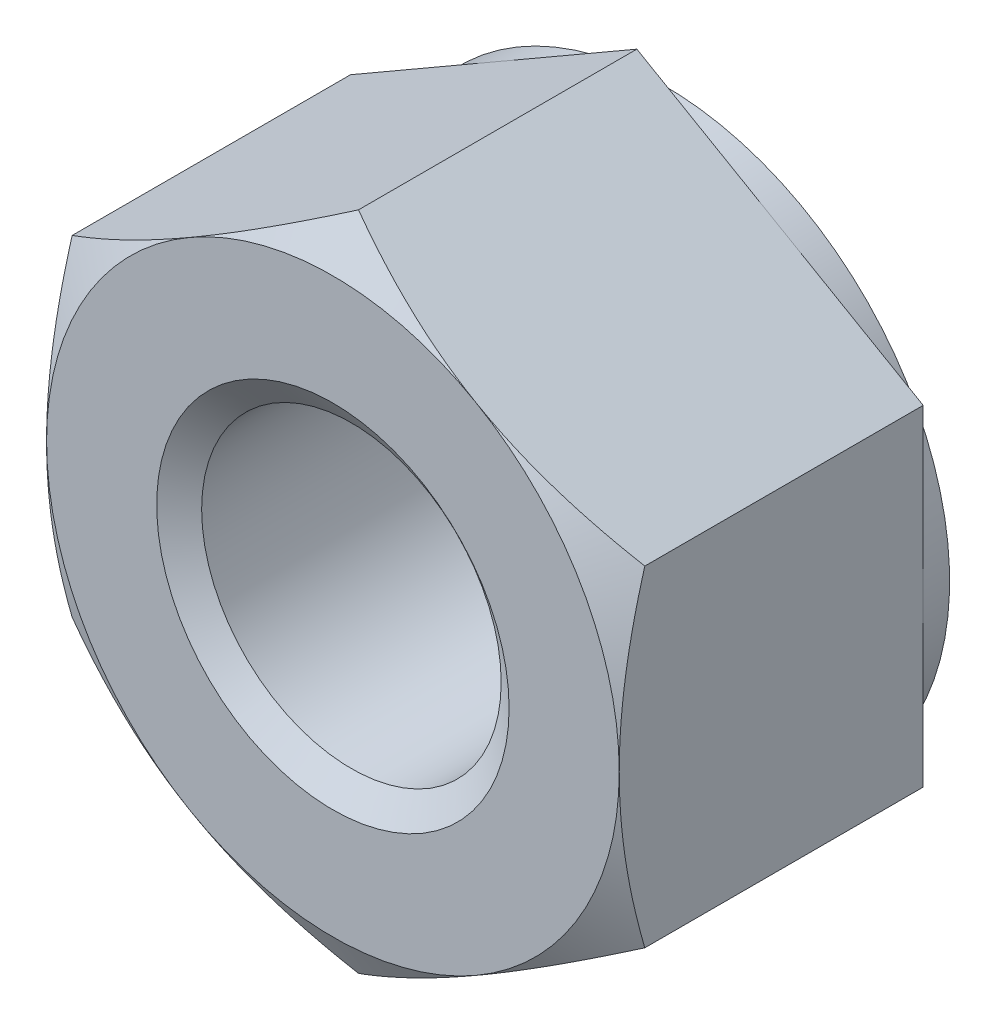
ISO-10303-21;
HEADER;
FILE_DESCRIPTION(('STEP AP214'),'2;1');
FILE_NAME('part.step','',(''),(''),'','','');
FILE_SCHEMA(('AUTOMOTIVE_DESIGN { 1 0 10303 214 1 1 1 1 }'));
ENDSEC;
DATA;
#1=APPLICATION_CONTEXT('core data for automotive mechanical design processes');
#2=APPLICATION_PROTOCOL_DEFINITION('international standard','automotive_design',2000,#1);
#3=PRODUCT_CONTEXT('',#1,'mechanical');
#4=PRODUCT('Part','Part','',(#3));
#5=PRODUCT_RELATED_PRODUCT_CATEGORY('part','',(#4));
#6=PRODUCT_DEFINITION_FORMATION('','',#4);
#7=PRODUCT_DEFINITION_CONTEXT('part definition',#1,'design');
#8=PRODUCT_DEFINITION('design','',#6,#7);
#9=PRODUCT_DEFINITION_SHAPE('','',#8);
#10=(LENGTH_UNIT() NAMED_UNIT(*) SI_UNIT(.MILLI.,.METRE.));
#11=(NAMED_UNIT(*) PLANE_ANGLE_UNIT() SI_UNIT($,.RADIAN.));
#12=(NAMED_UNIT(*) SI_UNIT($,.STERADIAN.) SOLID_ANGLE_UNIT());
#13=UNCERTAINTY_MEASURE_WITH_UNIT(LENGTH_MEASURE(1.E-05),#10,'distance_accuracy_value','');
#14=(GEOMETRIC_REPRESENTATION_CONTEXT(3) GLOBAL_UNCERTAINTY_ASSIGNED_CONTEXT((#13)) GLOBAL_UNIT_ASSIGNED_CONTEXT((#10,
#11,#12)) REPRESENTATION_CONTEXT('',''));
#15=CARTESIAN_POINT('',(0.,0.,0.));
#16=DIRECTION('',(0.,0.,1.));
#17=DIRECTION('',(1.,0.,0.));
#18=AXIS2_PLACEMENT_3D('',#15,#16,#17);
#19=CARTESIAN_POINT('',(0.,0.,-7.5));
#20=DIRECTION('',(0.,0.,1.));
#21=DIRECTION('',(1.,0.,0.));
#22=AXIS2_PLACEMENT_3D('',#19,#20,#21);
#23=CYLINDRICAL_SURFACE('',#22,3.4);
#24=CARTESIAN_POINT('',(0.,0.,-0.420124522925826));
#25=DIRECTION('',(0.,0.,1.));
#26=DIRECTION('',(1.,0.,0.));
#27=AXIS2_PLACEMENT_3D('',#24,#25,#26);
#28=CIRCLE('',#27,3.4);
#29=CARTESIAN_POINT('',(3.4,0.,-0.420124522925826));
#30=VERTEX_POINT('',#29);
#31=EDGE_CURVE('E153',#30,#30,#28,.F.);
#32=ORIENTED_EDGE('',*,*,#31,.F.);
#33=EDGE_LOOP('',(#32));
#34=FACE_BOUND('',#33,.T.);
#35=CARTESIAN_POINT('',(0.,0.,-7.05447547707417));
#36=DIRECTION('',(0.,0.,-1.));
#37=DIRECTION('',(-1.,0.,0.));
#38=AXIS2_PLACEMENT_3D('',#35,#36,#37);
#39=CIRCLE('',#38,3.4);
#40=CARTESIAN_POINT('',(-3.4,0.,-7.05447547707417));
#41=VERTEX_POINT('',#40);
#42=EDGE_CURVE('E41',#41,#41,#39,.F.);
#43=ORIENTED_EDGE('',*,*,#42,.F.);
#44=EDGE_LOOP('',(#43));
#45=FACE_BOUND('',#44,.T.);
#46=ADVANCED_FACE('F36',(#34,#45),#23,.F.);
#47=CARTESIAN_POINT('',(0.,7.50555349946514,-7.5));
#48=DIRECTION('',(-0.500000000000001,0.866025403784438,0.));
#49=DIRECTION('',(-0.866025403784438,-0.500000000000001,0.));
#50=AXIS2_PLACEMENT_3D('',#47,#48,#49);
#51=PLANE('',#50);
#52=DIRECTION('',(0.,0.,1.));
#53=VECTOR('',#52,1.);
#54=CARTESIAN_POINT('',(-6.5,3.75277674973256,-7.5));
#55=LINE('',#54,#53);
#56=CARTESIAN_POINT('',(-6.5,3.75277674973256,-6.9));
#57=VERTEX_POINT('',#56);
#58=CARTESIAN_POINT('',(-6.5,3.75277674973256,-0.580556583600771));
#59=VERTEX_POINT('',#58);
#60=EDGE_CURVE('E294',#57,#59,#55,.T.);
#61=ORIENTED_EDGE('',*,*,#60,.T.);
#62=CARTESIAN_POINT('',(-6.5002,3.75266127967872,-0.58062325180587));
#63=CARTESIAN_POINT('',(-6.35732254094112,3.8351516191275,-0.533004423075488));
#64=CARTESIAN_POINT('',(-6.21391236546509,3.91794952254312,-0.487546700602708));
#65=CARTESIAN_POINT('',(-5.9259273686828,4.08421773795794,-0.401548682023047));
#66=CARTESIAN_POINT('',(-5.78135207342874,4.16768832359105,-0.361010507228026));
#67=CARTESIAN_POINT('',(-5.34531134947997,4.41943655294051,-0.247571001123208));
#68=CARTESIAN_POINT('',(-5.05212471715368,4.58870793403689,-0.183047807128739));
#69=CARTESIAN_POINT('',(-4.61337625445563,4.84201947708215,-0.107386583547491));
#70=CARTESIAN_POINT('',(-4.46912536350531,4.92530276780316,-0.0858328564569863));
#71=CARTESIAN_POINT('',(-4.17997178286191,5.09224566542477,-0.0496903146061179));
#72=CARTESIAN_POINT('',(-4.03506915190111,5.17590523841627,-0.0351008844596657));
#73=CARTESIAN_POINT('',(-3.74501222057168,5.34336968579964,-0.013258752507346));
#74=CARTESIAN_POINT('',(-3.59985839394579,5.427174286676,-0.00599772432210689));
#75=CARTESIAN_POINT('',(-3.30942466302505,5.59485627940483,0.00103969741776935));
#76=CARTESIAN_POINT('',(-3.16414476276364,5.6787336689286,0.000816322187795753));
#77=CARTESIAN_POINT('',(-2.76612405757351,5.90853103021317,-0.0100834585151656));
#78=CARTESIAN_POINT('',(-2.51351353897243,6.05437578112763,-0.0283818178694138));
#79=CARTESIAN_POINT('',(-2.00997032176432,6.34509659313135,-0.0864063414576766));
#80=CARTESIAN_POINT('',(-1.75903939406692,6.48997163178545,-0.126152338538247));
#81=CARTESIAN_POINT('',(-1.25448277935568,6.78127752911039,-0.225505903202153));
#82=CARTESIAN_POINT('',(-1.00092075856409,6.92767163007068,-0.285534425638031));
#83=CARTESIAN_POINT('',(-0.497578064240955,7.21827667013277,-0.421774992509875));
#84=CARTESIAN_POINT('',(-0.247790944447037,7.36249133098589,-0.4979550341636));
#85=CARTESIAN_POINT('',(0.000199999999999409,7.50566896951898,-0.580623251805876));
#86=B_SPLINE_CURVE_WITH_KNOTS('',3,(#62,#63,#64,#65,#66,#67,#68,#69,#70,#71,#72,#73,#74,#75,#76,
#77,#78,#79,#80,#81,#82,#83,#84,#85),.UNSPECIFIED.,.F.,.F.,(4,2,2,2,2,2,2,2,2,2,2,4),(0.,
0.515105052395589,1.03043143507525,2.06322554824263,2.56697389547997,3.07067772176454,
3.57380860368928,4.0769239424252,4.9527935470566,5.82947446853467,6.72559912449737,
7.61996451221046),.UNSPECIFIED.);
#87=CARTESIAN_POINT('',(-3.25000000000001,5.62916512459885,0.));
#88=VERTEX_POINT('',#87);
#89=EDGE_CURVE('E60',#59,#88,#86,.T.);
#90=ORIENTED_EDGE('',*,*,#89,.T.);
#91=CARTESIAN_POINT('',(0.,7.50555349946514,-0.580556583600771));
#92=VERTEX_POINT('',#91);
#93=EDGE_CURVE('E167',#88,#92,#86,.T.);
#94=ORIENTED_EDGE('',*,*,#93,.T.);
#95=DIRECTION('',(0.,0.,1.));
#96=VECTOR('',#95,1.);
#97=CARTESIAN_POINT('',(0.,7.50555349946514,-7.5));
#98=LINE('',#97,#96);
#99=CARTESIAN_POINT('',(0.,7.50555349946514,-6.9));
#100=VERTEX_POINT('',#99);
#101=EDGE_CURVE('E282',#100,#92,#98,.T.);
#102=ORIENTED_EDGE('',*,*,#101,.F.);
#103=DIRECTION('',(-0.866025403784438,-0.500000000000001,0.));
#104=VECTOR('',#103,1.);
#105=CARTESIAN_POINT('',(0.,7.50555349946514,-6.9));
#106=LINE('',#105,#104);
#107=CARTESIAN_POINT('',(-3.25000000000001,5.62916512459885,-6.9));
#108=VERTEX_POINT('',#107);
#109=EDGE_CURVE('E270',#100,#108,#106,.T.);
#110=ORIENTED_EDGE('',*,*,#109,.T.);
#111=EDGE_CURVE('E266',#108,#57,#106,.T.);
#112=ORIENTED_EDGE('',*,*,#111,.T.);
#113=EDGE_LOOP('',(#61,#90,#94,#102,#110,#112));
#114=FACE_BOUND('',#113,.T.);
#115=ADVANCED_FACE('F38',(#114),#51,.T.);
#116=CARTESIAN_POINT('',(6.5,3.75277674973256,-7.5));
#117=DIRECTION('',(0.500000000000001,0.866025403784438,0.));
#118=DIRECTION('',(-0.866025403784438,0.500000000000001,0.));
#119=AXIS2_PLACEMENT_3D('',#116,#117,#118);
#120=PLANE('',#119);
#121=ORIENTED_EDGE('',*,*,#101,.T.);
#122=CARTESIAN_POINT('',(-0.000200000000000618,7.50566896951898,-0.580623251805875));
#123=CARTESIAN_POINT('',(0.142677459058881,7.4231786300702,-0.533004423075493));
#124=CARTESIAN_POINT('',(0.286087634534913,7.34038072665459,-0.487546700602713));
#125=CARTESIAN_POINT('',(0.574072631317196,7.17411251123976,-0.401548682023052));
#126=CARTESIAN_POINT('',(0.718647926571265,7.09064192560665,-0.36101050722803));
#127=CARTESIAN_POINT('',(1.15468865052004,6.83889369625719,-0.247571001123212));
#128=CARTESIAN_POINT('',(1.44787528284632,6.66962231516081,-0.183047807128741));
#129=CARTESIAN_POINT('',(1.88662374554438,6.41631077211555,-0.107386583547493));
#130=CARTESIAN_POINT('',(2.03087463649469,6.33302748139454,-0.0858328564569886));
#131=CARTESIAN_POINT('',(2.32002821713809,6.16608458377293,-0.0496903146061195));
#132=CARTESIAN_POINT('',(2.46493084809889,6.08242501078143,-0.0351008844596667));
#133=CARTESIAN_POINT('',(2.75498777942832,5.91496056339806,-0.0132587525073465));
#134=CARTESIAN_POINT('',(2.90014160605421,5.8311559625217,-0.00599772432210741));
#135=CARTESIAN_POINT('',(3.19057533697495,5.66347396979286,0.00103969741776911));
#136=CARTESIAN_POINT('',(3.33585523723636,5.5795965802691,0.000816322187795874));
#137=CARTESIAN_POINT('',(3.7338759424265,5.34979921898453,-0.0100834585151647));
#138=CARTESIAN_POINT('',(3.98648646102757,5.20395446807007,-0.0283818178694127));
#139=CARTESIAN_POINT('',(4.49002967823568,4.91323365606635,-0.0864063414576745));
#140=CARTESIAN_POINT('',(4.74096060593309,4.76835861741225,-0.126152338538244));
#141=CARTESIAN_POINT('',(5.24551722064432,4.47705272008731,-0.22550590320215));
#142=CARTESIAN_POINT('',(5.49907924143591,4.33065861912702,-0.285534425638028));
#143=CARTESIAN_POINT('',(6.00242193575905,4.04005357906493,-0.421774992509871));
#144=CARTESIAN_POINT('',(6.25220905555296,3.89583891821181,-0.497955034163595));
#145=CARTESIAN_POINT('',(6.5002,3.75266127967872,-0.58062325180587));
#146=B_SPLINE_CURVE_WITH_KNOTS('',3,(#122,#123,#124,#125,#126,#127,#128,#129,#130,#131,#132,
#133,#134,#135,#136,#137,#138,#139,#140,#141,#142,#143,#144,#145),.UNSPECIFIED.,.F.,.F.,(4,2,2,
2,2,2,2,2,2,2,2,4),(0.,0.51510505239559,1.03043143507525,2.06322554824263,2.56697389547997,
3.07067772176454,3.57380860368929,4.07692394242521,4.95279354705661,5.82947446853467,
6.72559912449737,7.61996451221046),.UNSPECIFIED.);
#147=CARTESIAN_POINT('',(3.25000000000001,5.62916512459885,0.));
#148=VERTEX_POINT('',#147);
#149=EDGE_CURVE('E164',#92,#148,#146,.T.);
#150=ORIENTED_EDGE('',*,*,#149,.T.);
#151=CARTESIAN_POINT('',(6.5,3.75277674973258,-0.580556583600771));
#152=VERTEX_POINT('',#151);
#153=EDGE_CURVE('E147',#148,#152,#146,.T.);
#154=ORIENTED_EDGE('',*,*,#153,.T.);
#155=DIRECTION('',(0.,0.,1.));
#156=VECTOR('',#155,1.);
#157=CARTESIAN_POINT('',(6.5,3.75277674973256,-7.5));
#158=LINE('',#157,#156);
#159=CARTESIAN_POINT('',(6.5,3.75277674973256,-6.9));
#160=VERTEX_POINT('',#159);
#161=EDGE_CURVE('E163',#160,#152,#158,.T.);
#162=ORIENTED_EDGE('',*,*,#161,.F.);
#163=DIRECTION('',(-0.866025403784438,0.500000000000001,0.));
#164=VECTOR('',#163,1.);
#165=CARTESIAN_POINT('',(6.5,3.75277674973256,-6.9));
#166=LINE('',#165,#164);
#167=CARTESIAN_POINT('',(3.25000000000001,5.62916512459885,-6.9));
#168=VERTEX_POINT('',#167);
#169=EDGE_CURVE('E278',#160,#168,#166,.T.);
#170=ORIENTED_EDGE('',*,*,#169,.T.);
#171=EDGE_CURVE('E274',#168,#100,#166,.T.);
#172=ORIENTED_EDGE('',*,*,#171,.T.);
#173=EDGE_LOOP('',(#121,#150,#154,#162,#170,#172));
#174=FACE_BOUND('',#173,.T.);
#175=ADVANCED_FACE('F241',(#174),#120,.T.);
#176=CARTESIAN_POINT('',(6.5,3.75277674973256,-7.5));
#177=DIRECTION('',(-1.,0.,0.));
#178=DIRECTION('',(0.,0.,1.));
#179=AXIS2_PLACEMENT_3D('',#176,#177,#178);
#180=PLANE('',#179);
#181=CARTESIAN_POINT('',(6.5,-9.95291698368313,-3.11042358451599));
#182=CARTESIAN_POINT('',(6.5,-9.66753022820205,-2.97250893962365));
#183=CARTESIAN_POINT('',(6.5,-9.38146872221018,-2.8359652810007));
#184=CARTESIAN_POINT('',(6.5,-8.80763137697964,-2.56640336373165));
#185=CARTESIAN_POINT('',(6.5,-8.51985525134959,-2.43338571546935));
#186=CARTESIAN_POINT('',(6.5,-7.94066929123456,-2.17095850209535));
#187=CARTESIAN_POINT('',(6.5,-7.64924808662454,-2.04157394066246));
#188=CARTESIAN_POINT('',(6.5,-7.06401043497073,-1.78836220262284));
#189=CARTESIAN_POINT('',(6.5,-6.77019411372554,-1.66453473633514));
#190=CARTESIAN_POINT('',(6.5,-6.17605150217578,-1.42244480194621));
#191=CARTESIAN_POINT('',(6.5,-5.87568957429354,-1.30426931829828));
#192=CARTESIAN_POINT('',(6.5,-5.27142269448723,-1.07717389386354));
#193=CARTESIAN_POINT('',(6.5,-4.9675173526422,-0.968254982821991));
#194=CARTESIAN_POINT('',(6.5,-4.35630541725461,-0.762599022073943));
#195=CARTESIAN_POINT('',(6.5,-4.04900762614673,-0.665836073792645));
#196=CARTESIAN_POINT('',(6.5,-3.43004022230997,-0.487635712034288));
#197=CARTESIAN_POINT('',(6.5,-3.11837202573309,-0.406193452076782));
#198=CARTESIAN_POINT('',(6.5,-2.49046594828965,-0.26258408019258));
#199=CARTESIAN_POINT('',(6.5,-2.17422687409775,-0.200422100523436));
#200=CARTESIAN_POINT('',(6.5,-1.5378916759482,-0.0995742225329258));
#201=CARTESIAN_POINT('',(6.5,-1.2177955485807,-0.0608883449673845));
#202=CARTESIAN_POINT('',(6.5,-0.737141963129277,-0.0229465620569955));
#203=CARTESIAN_POINT('',(6.5,-0.577336886979719,-0.0136452147630792));
#204=CARTESIAN_POINT('',(6.5,-0.257468906786594,-0.00181408796460747));
#205=CARTESIAN_POINT('',(6.5,-0.0974060061182575,0.000715779477276843));
#206=CARTESIAN_POINT('',(6.5,0.222635442153785,-0.00106401163083594));
#207=CARTESIAN_POINT('',(6.5,0.382614000823772,-0.0053717506870047));
#208=CARTESIAN_POINT('',(6.5,0.702250634961163,-0.0207175825196415));
#209=CARTESIAN_POINT('',(6.5,0.861908694024545,-0.0317560114013203));
#210=CARTESIAN_POINT('',(6.5,1.24887053403167,-0.0664368683339296));
#211=CARTESIAN_POINT('',(6.5,1.47587694728923,-0.0934518785931837));
#212=CARTESIAN_POINT('',(6.5,1.92815030612898,-0.159589888005031));
#213=CARTESIAN_POINT('',(6.5,2.15341675970355,-0.198716192016402));
#214=CARTESIAN_POINT('',(6.5,2.6020242784339,-0.287689170365799));
#215=CARTESIAN_POINT('',(6.5,2.82536331401076,-0.337545980881487));
#216=CARTESIAN_POINT('',(6.5,3.26974354822384,-0.44645876411308));
#217=CARTESIAN_POINT('',(6.5,3.49078496123694,-0.505513870223689));
#218=CARTESIAN_POINT('',(6.5,3.93601414582635,-0.632954116493084));
#219=CARTESIAN_POINT('',(6.5,4.1601462295919,-0.701532472923335));
#220=CARTESIAN_POINT('',(6.5,4.60604131565917,-0.845465123541097));
#221=CARTESIAN_POINT('',(6.5,4.82780583559526,-0.920814744092753));
#222=CARTESIAN_POINT('',(6.5,5.26807593346454,-1.07673350293345));
#223=CARTESIAN_POINT('',(6.5,5.4865928289811,-1.15727087504746));
#224=CARTESIAN_POINT('',(6.5,5.92193123194619,-1.32307270438627));
#225=CARTESIAN_POINT('',(6.5,6.13875201319725,-1.40833907213759));
#226=CARTESIAN_POINT('',(6.5,6.35478510853348,-1.49550213563036));
#227=B_SPLINE_CURVE_WITH_KNOTS('',3,(#181,#182,#183,#184,#185,#186,#187,#188,#189,#190,#191,
#192,#193,#194,#195,#196,#197,#198,#199,#200,#201,#202,#203,#204,#205,#206,#207,#208,#209,#210,
#211,#212,#213,#214,#215,#216,#217,#218,#219,#220,#221,#222,#223,#224,#225,#226),.UNSPECIFIED.,
.F.,.F.,(4,2,2,2,2,2,2,2,2,2,2,2,2,2,2,2,2,2,2,2,2,2,4),(0.,0.950904162864942,1.90197187472378,
2.85848216299728,3.81494253212838,4.78314526620908,5.75145556717361,6.71766655133576,
7.68357137261129,8.64973308985235,9.61589566130056,10.0960003863608,10.5760988765458,
11.0560626144432,11.5360503218788,12.2214931749033,12.9071232326805,13.5934038106301,
14.2796197706252,14.9826563668411,15.6852113891479,16.3838119598016,17.082696852468),.UNSPECIFIED.);
#228=CARTESIAN_POINT('',(6.5,-3.75277674973258,-0.580556583600771));
#229=VERTEX_POINT('',#228);
#230=CARTESIAN_POINT('',(6.5,0.,0.));
#231=VERTEX_POINT('',#230);
#232=EDGE_CURVE('E128',#229,#231,#227,.T.);
#233=ORIENTED_EDGE('',*,*,#232,.F.);
#234=DIRECTION('',(0.,0.,1.));
#235=VECTOR('',#234,1.);
#236=CARTESIAN_POINT('',(6.5,-3.75277674973258,-7.5));
#237=LINE('',#236,#235);
#238=CARTESIAN_POINT('',(6.5,-3.75277674973258,-6.9));
#239=VERTEX_POINT('',#238);
#240=EDGE_CURVE('E287',#239,#229,#237,.T.);
#241=ORIENTED_EDGE('',*,*,#240,.F.);
#242=DIRECTION('',(0.,-1.,0.));
#243=VECTOR('',#242,1.);
#244=CARTESIAN_POINT('',(6.5,3.75277674973256,-6.9));
#245=LINE('',#244,#243);
#246=CARTESIAN_POINT('',(6.5,0.,-6.9));
#247=VERTEX_POINT('',#246);
#248=EDGE_CURVE('E279',#247,#239,#245,.T.);
#249=ORIENTED_EDGE('',*,*,#248,.F.);
#250=EDGE_CURVE('E281',#160,#247,#245,.T.);
#251=ORIENTED_EDGE('',*,*,#250,.F.);
#252=ORIENTED_EDGE('',*,*,#161,.T.);
#253=EDGE_CURVE('E141',#231,#152,#227,.T.);
#254=ORIENTED_EDGE('',*,*,#253,.F.);
#255=EDGE_LOOP('',(#233,#241,#249,#251,#252,#254));
#256=FACE_BOUND('',#255,.T.);
#257=ADVANCED_FACE('F160',(#256),#180,.F.);
#258=CARTESIAN_POINT('',(0.,-7.50555349946516,-7.5));
#259=DIRECTION('',(0.500000000000001,-0.866025403784438,0.));
#260=DIRECTION('',(0.866025403784438,0.500000000000001,0.));
#261=AXIS2_PLACEMENT_3D('',#258,#259,#260);
#262=PLANE('',#261);
#263=ORIENTED_EDGE('',*,*,#240,.T.);
#264=CARTESIAN_POINT('',(6.5002,-3.75266127967874,-0.580623251805876));
#265=CARTESIAN_POINT('',(6.35732254094112,-3.83515161912752,-0.533004423075493));
#266=CARTESIAN_POINT('',(6.21391236546509,-3.91794952254314,-0.487546700602714));
#267=CARTESIAN_POINT('',(5.9259273686828,-4.08421773795796,-0.401548682023052));
#268=CARTESIAN_POINT('',(5.78135207342873,-4.16768832359107,-0.361010507228032));
#269=CARTESIAN_POINT('',(5.34531134947996,-4.41943655294053,-0.247571001123215));
#270=CARTESIAN_POINT('',(5.05212471715368,-4.58870793403691,-0.183047807128746));
#271=CARTESIAN_POINT('',(4.61337625445562,-4.84201947708217,-0.107386583547498));
#272=CARTESIAN_POINT('',(4.46912536350531,-4.92530276780318,-0.0858328564569939));
#273=CARTESIAN_POINT('',(4.17997178286191,-5.09224566542479,-0.0496903146061258));
#274=CARTESIAN_POINT('',(4.03506915190111,-5.17590523841629,-0.0351008844596737));
#275=CARTESIAN_POINT('',(3.74501222057168,-5.34336968579966,-0.0132587525073545));
#276=CARTESIAN_POINT('',(3.59985839394579,-5.42717428667602,-0.00599772432211574));
#277=CARTESIAN_POINT('',(3.30942466302505,-5.59485627940486,0.00103969741776017));
#278=CARTESIAN_POINT('',(3.16414476276364,-5.67873366892862,0.000816322187786624));
#279=CARTESIAN_POINT('',(2.7661240575735,-5.90853103021319,-0.010083458515175));
#280=CARTESIAN_POINT('',(2.51351353897242,-6.05437578112766,-0.0283818178694239));
#281=CARTESIAN_POINT('',(2.00997032176432,-6.34509659313137,-0.0864063414576872));
#282=CARTESIAN_POINT('',(1.75903939406691,-6.48997163178547,-0.126152338538257));
#283=CARTESIAN_POINT('',(1.25448277935568,-6.78127752911041,-0.225505903202163));
#284=CARTESIAN_POINT('',(1.00092075856408,-6.9276716300707,-0.285534425638042));
#285=CARTESIAN_POINT('',(0.497578064240954,-7.21827667013279,-0.421774992509885));
#286=CARTESIAN_POINT('',(0.247790944447036,-7.36249133098591,-0.497955034163611));
#287=CARTESIAN_POINT('',(-0.000199999999999124,-7.505668969519,-0.580623251805885));
#288=B_SPLINE_CURVE_WITH_KNOTS('',3,(#264,#265,#266,#267,#268,#269,#270,#271,#272,#273,#274,
#275,#276,#277,#278,#279,#280,#281,#282,#283,#284,#285,#286,#287),.UNSPECIFIED.,.F.,.F.,(4,2,2,
2,2,2,2,2,2,2,2,4),(0.,0.515105052395589,1.03043143507525,2.06322554824263,2.56697389547997,
3.07067772176454,3.57380860368928,4.07692394242521,4.95279354705661,5.82947446853467,
6.72559912449737,7.61996451221046),.UNSPECIFIED.);
#289=CARTESIAN_POINT('',(3.25000000000001,-5.62916512459885,0.));
#290=VERTEX_POINT('',#289);
#291=EDGE_CURVE('E135',#229,#290,#288,.T.);
#292=ORIENTED_EDGE('',*,*,#291,.T.);
#293=CARTESIAN_POINT('',(0.,-7.50555349946514,-0.580556583600771));
#294=VERTEX_POINT('',#293);
#295=EDGE_CURVE('E175',#290,#294,#288,.T.);
#296=ORIENTED_EDGE('',*,*,#295,.T.);
#297=DIRECTION('',(0.,0.,1.));
#298=VECTOR('',#297,1.);
#299=CARTESIAN_POINT('',(0.,-7.50555349946516,-7.5));
#300=LINE('',#299,#298);
#301=CARTESIAN_POINT('',(0.,-7.50555349946516,-6.9));
#302=VERTEX_POINT('',#301);
#303=EDGE_CURVE('E289',#302,#294,#300,.T.);
#304=ORIENTED_EDGE('',*,*,#303,.F.);
#305=DIRECTION('',(0.866025403784438,0.500000000000001,0.));
#306=VECTOR('',#305,1.);
#307=CARTESIAN_POINT('',(0.,-7.50555349946516,-6.9));
#308=LINE('',#307,#306);
#309=CARTESIAN_POINT('',(3.25000000000002,-5.62916512459886,-6.9));
#310=VERTEX_POINT('',#309);
#311=EDGE_CURVE('E271',#302,#310,#308,.T.);
#312=ORIENTED_EDGE('',*,*,#311,.T.);
#313=EDGE_CURVE('E275',#310,#239,#308,.T.);
#314=ORIENTED_EDGE('',*,*,#313,.T.);
#315=EDGE_LOOP('',(#263,#292,#296,#304,#312,#314));
#316=FACE_BOUND('',#315,.T.);
#317=ADVANCED_FACE('F222',(#316),#262,.T.);
#318=CARTESIAN_POINT('',(-6.5,-3.75277674973258,-7.5));
#319=DIRECTION('',(-0.500000000000001,-0.866025403784438,0.));
#320=DIRECTION('',(0.866025403784438,-0.500000000000001,0.));
#321=AXIS2_PLACEMENT_3D('',#318,#319,#320);
#322=PLANE('',#321);
#323=ORIENTED_EDGE('',*,*,#303,.T.);
#324=CARTESIAN_POINT('',(0.000200000000000501,-7.505668969519,-0.580623251805886));
#325=CARTESIAN_POINT('',(-0.14267745905888,-7.42317863007022,-0.533004423075504));
#326=CARTESIAN_POINT('',(-0.286087634534913,-7.3403807266546,-0.487546700602724));
#327=CARTESIAN_POINT('',(-0.574072631317196,-7.17411251123978,-0.401548682023062));
#328=CARTESIAN_POINT('',(-0.718647926571266,-7.09064192560667,-0.36101050722804));
#329=CARTESIAN_POINT('',(-1.15468865052004,-6.83889369625721,-0.247571001123222));
#330=CARTESIAN_POINT('',(-1.44787528284632,-6.66962231516083,-0.183047807128752));
#331=CARTESIAN_POINT('',(-1.88662374554438,-6.41631077211557,-0.107386583547503));
#332=CARTESIAN_POINT('',(-2.0308746364947,-6.33302748139456,-0.0858328564569981));
#333=CARTESIAN_POINT('',(-2.3200282171381,-6.16608458377295,-0.0496903146061291));
#334=CARTESIAN_POINT('',(-2.4649308480989,-6.08242501078144,-0.0351008844596765));
#335=CARTESIAN_POINT('',(-2.75498777942833,-5.91496056339808,-0.0132587525073562));
#336=CARTESIAN_POINT('',(-2.90014160605422,-5.83115596252172,-0.00599772432211692));
#337=CARTESIAN_POINT('',(-3.19057533697496,-5.66347396979288,0.00103969741775959));
#338=CARTESIAN_POINT('',(-3.33585523723637,-5.57959658026911,0.000816322187786106));
#339=CARTESIAN_POINT('',(-3.7338759424265,-5.34979921898454,-0.0100834585151744));
#340=CARTESIAN_POINT('',(-3.98648646102758,-5.20395446807008,-0.0283818178694216));
#341=CARTESIAN_POINT('',(-4.49002967823569,-4.91323365606637,-0.0864063414576829));
#342=CARTESIAN_POINT('',(-4.74096060593309,-4.76835861741227,-0.126152338538253));
#343=CARTESIAN_POINT('',(-5.24551722064433,-4.47705272008733,-0.225505903202158));
#344=CARTESIAN_POINT('',(-5.49907924143592,-4.33065861912704,-0.285534425638035));
#345=CARTESIAN_POINT('',(-6.00242193575905,-4.04005357906495,-0.421774992509877));
#346=CARTESIAN_POINT('',(-6.25220905555296,-3.89583891821183,-0.497955034163601));
#347=CARTESIAN_POINT('',(-6.5002,-3.75266127967874,-0.580623251805876));
#348=B_SPLINE_CURVE_WITH_KNOTS('',3,(#324,#325,#326,#327,#328,#329,#330,#331,#332,#333,#334,
#335,#336,#337,#338,#339,#340,#341,#342,#343,#344,#345,#346,#347),.UNSPECIFIED.,.F.,.F.,(4,2,2,
2,2,2,2,2,2,2,2,4),(0.,0.51510505239559,1.03043143507525,2.06322554824263,2.56697389547998,
3.07067772176455,3.57380860368929,4.07692394242522,4.95279354705661,5.82947446853468,
6.72559912449737,7.61996451221046),.UNSPECIFIED.);
#349=CARTESIAN_POINT('',(-3.25000000000001,-5.62916512459885,0.));
#350=VERTEX_POINT('',#349);
#351=EDGE_CURVE('E216',#294,#350,#348,.T.);
#352=ORIENTED_EDGE('',*,*,#351,.T.);
#353=CARTESIAN_POINT('',(-6.5,-3.75277674973258,-0.580556583600771));
#354=VERTEX_POINT('',#353);
#355=EDGE_CURVE('E208',#350,#354,#348,.T.);
#356=ORIENTED_EDGE('',*,*,#355,.T.);
#357=DIRECTION('',(0.,0.,1.));
#358=VECTOR('',#357,1.);
#359=CARTESIAN_POINT('',(-6.5,-3.75277674973258,-7.5));
#360=LINE('',#359,#358);
#361=CARTESIAN_POINT('',(-6.5,-3.75277674973258,-6.9));
#362=VERTEX_POINT('',#361);
#363=EDGE_CURVE('E292',#362,#354,#360,.T.);
#364=ORIENTED_EDGE('',*,*,#363,.F.);
#365=DIRECTION('',(0.866025403784438,-0.500000000000001,0.));
#366=VECTOR('',#365,1.);
#367=CARTESIAN_POINT('',(-6.5,-3.75277674973258,-6.9));
#368=LINE('',#367,#366);
#369=CARTESIAN_POINT('',(-3.25000000000001,-5.62916512459886,-6.9));
#370=VERTEX_POINT('',#369);
#371=EDGE_CURVE('E261',#362,#370,#368,.T.);
#372=ORIENTED_EDGE('',*,*,#371,.T.);
#373=EDGE_CURVE('E267',#370,#302,#368,.T.);
#374=ORIENTED_EDGE('',*,*,#373,.T.);
#375=EDGE_LOOP('',(#323,#352,#356,#364,#372,#374));
#376=FACE_BOUND('',#375,.T.);
#377=ADVANCED_FACE('F218',(#376),#322,.T.);
#378=CARTESIAN_POINT('',(-6.5,3.75277674973256,-7.5));
#379=DIRECTION('',(-1.,0.,0.));
#380=DIRECTION('',(0.,0.,1.));
#381=AXIS2_PLACEMENT_3D('',#378,#379,#380);
#382=PLANE('',#381);
#383=ORIENTED_EDGE('',*,*,#363,.T.);
#384=CARTESIAN_POINT('',(-6.5,-9.95291698368314,-3.11042358451599));
#385=CARTESIAN_POINT('',(-6.5,-9.66753022820206,-2.97250893962365));
#386=CARTESIAN_POINT('',(-6.5,-9.38146872221018,-2.8359652810007));
#387=CARTESIAN_POINT('',(-6.5,-8.80763137697965,-2.56640336373166));
#388=CARTESIAN_POINT('',(-6.5,-8.5198552513496,-2.43338571546936));
#389=CARTESIAN_POINT('',(-6.5,-7.94066929123456,-2.17095850209535));
#390=CARTESIAN_POINT('',(-6.5,-7.64924808662455,-2.04157394066247));
#391=CARTESIAN_POINT('',(-6.5,-7.06401043497074,-1.78836220262284));
#392=CARTESIAN_POINT('',(-6.5,-6.77019411372555,-1.66453473633514));
#393=CARTESIAN_POINT('',(-6.5,-6.17605150217578,-1.42244480194622));
#394=CARTESIAN_POINT('',(-6.5,-5.87568957429354,-1.30426931829828));
#395=CARTESIAN_POINT('',(-6.5,-5.27142269448723,-1.07717389386354));
#396=CARTESIAN_POINT('',(-6.5,-4.9675173526422,-0.968254982821991));
#397=CARTESIAN_POINT('',(-6.5,-4.35630541725461,-0.762599022073943));
#398=CARTESIAN_POINT('',(-6.5,-4.04900762614674,-0.665836073792645));
#399=CARTESIAN_POINT('',(-6.5,-3.43004022230997,-0.487635712034288));
#400=CARTESIAN_POINT('',(-6.5,-3.11837202573309,-0.406193452076782));
#401=CARTESIAN_POINT('',(-6.5,-2.49046594828965,-0.26258408019258));
#402=CARTESIAN_POINT('',(-6.5,-2.17422687409775,-0.200422100523436));
#403=CARTESIAN_POINT('',(-6.5,-1.5378916759482,-0.0995742225329256));
#404=CARTESIAN_POINT('',(-6.5,-1.2177955485807,-0.0608883449673841));
#405=CARTESIAN_POINT('',(-6.5,-0.737141963129278,-0.0229465620569957));
#406=CARTESIAN_POINT('',(-6.5,-0.57733688697972,-0.0136452147630797));
#407=CARTESIAN_POINT('',(-6.5,-0.257468906786595,-0.0018140879646079));
#408=CARTESIAN_POINT('',(-6.5,-0.0974060061182589,0.000715779477276737));
#409=CARTESIAN_POINT('',(-6.5,0.222635442153784,-0.00106401163083583));
#410=CARTESIAN_POINT('',(-6.5,0.382614000823772,-0.00537175068700473));
#411=CARTESIAN_POINT('',(-6.5,0.702250634961163,-0.0207175825196415));
#412=CARTESIAN_POINT('',(-6.5,0.861908694024545,-0.03175601140132));
#413=CARTESIAN_POINT('',(-6.5,1.24887053403166,-0.0664368683339289));
#414=CARTESIAN_POINT('',(-6.5,1.47587694728923,-0.0934518785931831));
#415=CARTESIAN_POINT('',(-6.5,1.92815030612898,-0.15958988800503));
#416=CARTESIAN_POINT('',(-6.5,2.15341675970355,-0.198716192016402));
#417=CARTESIAN_POINT('',(-6.5,2.6020242784339,-0.287689170365798));
#418=CARTESIAN_POINT('',(-6.5,2.82536331401075,-0.337545980881486));
#419=CARTESIAN_POINT('',(-6.5,3.26974354822384,-0.446458764113078));
#420=CARTESIAN_POINT('',(-6.5,3.49078496123693,-0.505513870223687));
#421=CARTESIAN_POINT('',(-6.5,3.93601414582635,-0.632954116493083));
#422=CARTESIAN_POINT('',(-6.5,4.16014622959189,-0.701532472923335));
#423=CARTESIAN_POINT('',(-6.5,4.60604131565917,-0.845465123541096));
#424=CARTESIAN_POINT('',(-6.5,4.82780583559526,-0.920814744092751));
#425=CARTESIAN_POINT('',(-6.5,5.26807593346454,-1.07673350293344));
#426=CARTESIAN_POINT('',(-6.5,5.48659282898109,-1.15727087504746));
#427=CARTESIAN_POINT('',(-6.5,5.92193123194618,-1.32307270438627));
#428=CARTESIAN_POINT('',(-6.5,6.13875201319725,-1.40833907213758));
#429=CARTESIAN_POINT('',(-6.5,6.35478510853347,-1.49550213563036));
#430=B_SPLINE_CURVE_WITH_KNOTS('',3,(#384,#385,#386,#387,#388,#389,#390,#391,#392,#393,#394,
#395,#396,#397,#398,#399,#400,#401,#402,#403,#404,#405,#406,#407,#408,#409,#410,#411,#412,#413,
#414,#415,#416,#417,#418,#419,#420,#421,#422,#423,#424,#425,#426,#427,#428,#429),.UNSPECIFIED.,
.F.,.F.,(4,2,2,2,2,2,2,2,2,2,2,2,2,2,2,2,2,2,2,2,2,2,4),(0.,0.95090416286494,1.90197187472378,
2.85848216299727,3.81494253212837,4.78314526620908,5.75145556717361,6.71766655133576,
7.68357137261129,8.64973308985235,9.61589566130056,10.0960003863608,10.5760988765458,
11.0560626144432,11.5360503218788,12.2214931749033,12.9071232326805,13.5934038106301,
14.2796197706252,14.9826563668411,15.6852113891479,16.3838119598016,17.082696852468),.UNSPECIFIED.);
#431=CARTESIAN_POINT('',(-6.5,0.,0.));
#432=VERTEX_POINT('',#431);
#433=EDGE_CURVE('E217',#354,#432,#430,.T.);
#434=ORIENTED_EDGE('',*,*,#433,.T.);
#435=EDGE_CURVE('E152',#432,#59,#430,.T.);
#436=ORIENTED_EDGE('',*,*,#435,.T.);
#437=ORIENTED_EDGE('',*,*,#60,.F.);
#438=DIRECTION('',(0.,-1.,0.));
#439=VECTOR('',#438,1.);
#440=CARTESIAN_POINT('',(-6.5,3.75277674973256,-6.9));
#441=LINE('',#440,#439);
#442=CARTESIAN_POINT('',(-6.5,0.,-6.9));
#443=VERTEX_POINT('',#442);
#444=EDGE_CURVE('E301',#57,#443,#441,.T.);
#445=ORIENTED_EDGE('',*,*,#444,.T.);
#446=EDGE_CURVE('E299',#443,#362,#441,.T.);
#447=ORIENTED_EDGE('',*,*,#446,.T.);
#448=EDGE_LOOP('',(#383,#434,#436,#437,#445,#447));
#449=FACE_BOUND('',#448,.T.);
#450=ADVANCED_FACE('F221',(#449),#382,.T.);
#451=CARTESIAN_POINT('',(0.,7.50555349946514,0.));
#452=DIRECTION('',(0.,0.,-1.));
#453=DIRECTION('',(-1.,0.,0.));
#454=AXIS2_PLACEMENT_3D('',#451,#452,#453);
#455=PLANE('',#454);
#456=CARTESIAN_POINT('',(0.,0.,0.));
#457=DIRECTION('',(0.,0.,1.));
#458=DIRECTION('',(1.,0.,0.));
#459=AXIS2_PLACEMENT_3D('',#456,#457,#458);
#460=CIRCLE('',#459,4.);
#461=CARTESIAN_POINT('',(4.,0.,0.));
#462=VERTEX_POINT('',#461);
#463=EDGE_CURVE('E304',#462,#462,#460,.T.);
#464=ORIENTED_EDGE('',*,*,#463,.F.);
#465=EDGE_LOOP('',(#464));
#466=FACE_BOUND('',#465,.T.);
#467=CARTESIAN_POINT('',(0.,0.,0.));
#468=DIRECTION('',(0.,0.,-1.));
#469=DIRECTION('',(-1.,0.,0.));
#470=AXIS2_PLACEMENT_3D('',#467,#468,#469);
#471=CIRCLE('',#470,6.5);
#472=EDGE_CURVE('E48',#88,#432,#471,.F.);
#473=ORIENTED_EDGE('',*,*,#472,.T.);
#474=EDGE_CURVE('E12',#432,#350,#471,.F.);
#475=ORIENTED_EDGE('',*,*,#474,.T.);
#476=EDGE_CURVE('E46',#350,#290,#471,.F.);
#477=ORIENTED_EDGE('',*,*,#476,.T.);
#478=EDGE_CURVE('E132',#290,#231,#471,.F.);
#479=ORIENTED_EDGE('',*,*,#478,.T.);
#480=CARTESIAN_POINT('',(0.,0.,0.));
#481=DIRECTION('',(0.,0.,1.));
#482=DIRECTION('',(1.,0.,0.));
#483=AXIS2_PLACEMENT_3D('',#480,#481,#482);
#484=CIRCLE('',#483,6.5);
#485=EDGE_CURVE('E144',#231,#148,#484,.T.);
#486=ORIENTED_EDGE('',*,*,#485,.T.);
#487=EDGE_CURVE('E158',#148,#88,#471,.F.);
#488=ORIENTED_EDGE('',*,*,#487,.T.);
#489=EDGE_LOOP('',(#473,#475,#477,#479,#486,#488));
#490=FACE_BOUND('',#489,.T.);
#491=ADVANCED_FACE('F156',(#466,#490),#455,.F.);
#492=CARTESIAN_POINT('',(0.,7.50555349946514,-7.5));
#493=DIRECTION('',(0.,0.,-1.));
#494=DIRECTION('',(-1.,0.,0.));
#495=AXIS2_PLACEMENT_3D('',#492,#493,#494);
#496=PLANE('',#495);
#497=CARTESIAN_POINT('',(0.,0.,-7.5));
#498=DIRECTION('',(0.,0.,-1.));
#499=DIRECTION('',(-1.,0.,0.));
#500=AXIS2_PLACEMENT_3D('',#497,#498,#499);
#501=CIRCLE('',#500,4.);
#502=CARTESIAN_POINT('',(-4.,0.,-7.5));
#503=VERTEX_POINT('',#502);
#504=EDGE_CURVE('E305',#503,#503,#501,.F.);
#505=ORIENTED_EDGE('',*,*,#504,.T.);
#506=EDGE_LOOP('',(#505));
#507=FACE_BOUND('',#506,.T.);
#508=CARTESIAN_POINT('',(0.,0.,-7.5));
#509=DIRECTION('',(0.,0.,-1.));
#510=DIRECTION('',(-1.,0.,0.));
#511=AXIS2_PLACEMENT_3D('',#508,#509,#510);
#512=CIRCLE('',#511,6.5);
#513=CARTESIAN_POINT('',(-6.5,0.,-7.5));
#514=VERTEX_POINT('',#513);
#515=EDGE_CURVE('E285',#514,#514,#512,.F.);
#516=ORIENTED_EDGE('',*,*,#515,.F.);
#517=EDGE_LOOP('',(#516));
#518=FACE_BOUND('',#517,.T.);
#519=ADVANCED_FACE('F231',(#507,#518),#496,.T.);
#520=CARTESIAN_POINT('',(0.,17.5055534994651,-6.9));
#521=DIRECTION('',(0.,0.,-1.));
#522=DIRECTION('',(-1.,0.,0.));
#523=AXIS2_PLACEMENT_3D('',#520,#521,#522);
#524=PLANE('',#523);
#525=ORIENTED_EDGE('',*,*,#250,.T.);
#526=CARTESIAN_POINT('',(0.,0.,-6.9));
#527=DIRECTION('',(0.,0.,1.));
#528=DIRECTION('',(1.,0.,0.));
#529=AXIS2_PLACEMENT_3D('',#526,#527,#528);
#530=CIRCLE('',#529,6.5);
#531=EDGE_CURVE('E258',#247,#168,#530,.T.);
#532=ORIENTED_EDGE('',*,*,#531,.T.);
#533=ORIENTED_EDGE('',*,*,#169,.F.);
#534=EDGE_LOOP('',(#525,#532,#533));
#535=FACE_BOUND('',#534,.T.);
#536=ADVANCED_FACE('F248',(#535),#524,.T.);
#537=ORIENTED_EDGE('',*,*,#248,.T.);
#538=ORIENTED_EDGE('',*,*,#313,.F.);
#539=EDGE_CURVE('E263',#310,#247,#530,.T.);
#540=ORIENTED_EDGE('',*,*,#539,.T.);
#541=EDGE_LOOP('',(#537,#538,#540));
#542=FACE_BOUND('',#541,.T.);
#543=ADVANCED_FACE('F451',(#542),#524,.T.);
#544=EDGE_CURVE('E262',#168,#108,#530,.T.);
#545=ORIENTED_EDGE('',*,*,#544,.T.);
#546=ORIENTED_EDGE('',*,*,#109,.F.);
#547=ORIENTED_EDGE('',*,*,#171,.F.);
#548=EDGE_LOOP('',(#545,#546,#547));
#549=FACE_BOUND('',#548,.T.);
#550=ADVANCED_FACE('F442',(#549),#524,.T.);
#551=ORIENTED_EDGE('',*,*,#373,.F.);
#552=EDGE_CURVE('E515',#370,#310,#530,.T.);
#553=ORIENTED_EDGE('',*,*,#552,.T.);
#554=ORIENTED_EDGE('',*,*,#311,.F.);
#555=EDGE_LOOP('',(#551,#553,#554));
#556=FACE_BOUND('',#555,.T.);
#557=ADVANCED_FACE('F433',(#556),#524,.T.);
#558=EDGE_CURVE('E529',#108,#443,#530,.T.);
#559=ORIENTED_EDGE('',*,*,#558,.T.);
#560=ORIENTED_EDGE('',*,*,#444,.F.);
#561=ORIENTED_EDGE('',*,*,#111,.F.);
#562=EDGE_LOOP('',(#559,#560,#561));
#563=FACE_BOUND('',#562,.T.);
#564=ADVANCED_FACE('F417',(#563),#524,.T.);
#565=CARTESIAN_POINT('',(0.,0.,0.));
#566=DIRECTION('',(0.,0.,1.));
#567=DIRECTION('',(1.,0.,0.));
#568=AXIS2_PLACEMENT_3D('',#565,#566,#567);
#569=CYLINDRICAL_SURFACE('',#568,6.5);
#570=ORIENTED_EDGE('',*,*,#515,.T.);
#571=EDGE_LOOP('',(#570));
#572=FACE_BOUND('',#571,.T.);
#573=ORIENTED_EDGE('',*,*,#544,.F.);
#574=ORIENTED_EDGE('',*,*,#531,.F.);
#575=ORIENTED_EDGE('',*,*,#539,.F.);
#576=ORIENTED_EDGE('',*,*,#552,.F.);
#577=EDGE_CURVE('E531',#443,#370,#530,.T.);
#578=ORIENTED_EDGE('',*,*,#577,.F.);
#579=ORIENTED_EDGE('',*,*,#558,.F.);
#580=EDGE_LOOP('',(#573,#574,#575,#576,#578,#579));
#581=FACE_BOUND('',#580,.T.);
#582=ADVANCED_FACE('F246',(#572,#581),#569,.T.);
#583=ORIENTED_EDGE('',*,*,#446,.F.);
#584=ORIENTED_EDGE('',*,*,#577,.T.);
#585=ORIENTED_EDGE('',*,*,#371,.F.);
#586=EDGE_LOOP('',(#583,#584,#585));
#587=FACE_BOUND('',#586,.T.);
#588=ADVANCED_FACE('F197',(#587),#524,.T.);
#589=CARTESIAN_POINT('',(0.,0.,0.));
#590=DIRECTION('',(0.,0.,-1.));
#591=DIRECTION('',(-1.,0.,0.));
#592=AXIS2_PLACEMENT_3D('',#589,#590,#591);
#593=CONICAL_SURFACE('',#592,6.5,1.0471975511966);
#594=ORIENTED_EDGE('',*,*,#435,.F.);
#595=ORIENTED_EDGE('',*,*,#472,.F.);
#596=ORIENTED_EDGE('',*,*,#89,.F.);
#597=EDGE_LOOP('',(#594,#595,#596));
#598=FACE_BOUND('',#597,.T.);
#599=ADVANCED_FACE('F379',(#598),#593,.T.);
#600=ORIENTED_EDGE('',*,*,#487,.F.);
#601=ORIENTED_EDGE('',*,*,#149,.F.);
#602=ORIENTED_EDGE('',*,*,#93,.F.);
#603=EDGE_LOOP('',(#600,#601,#602));
#604=FACE_BOUND('',#603,.T.);
#605=ADVANCED_FACE('F195',(#604),#593,.T.);
#606=ORIENTED_EDGE('',*,*,#485,.F.);
#607=ORIENTED_EDGE('',*,*,#253,.T.);
#608=ORIENTED_EDGE('',*,*,#153,.F.);
#609=EDGE_LOOP('',(#606,#607,#608));
#610=FACE_BOUND('',#609,.T.);
#611=ADVANCED_FACE('F145',(#610),#593,.T.);
#612=ORIENTED_EDGE('',*,*,#232,.T.);
#613=ORIENTED_EDGE('',*,*,#478,.F.);
#614=ORIENTED_EDGE('',*,*,#291,.F.);
#615=EDGE_LOOP('',(#612,#613,#614));
#616=FACE_BOUND('',#615,.T.);
#617=ADVANCED_FACE('F130',(#616),#593,.T.);
#618=ORIENTED_EDGE('',*,*,#476,.F.);
#619=ORIENTED_EDGE('',*,*,#351,.F.);
#620=ORIENTED_EDGE('',*,*,#295,.F.);
#621=EDGE_LOOP('',(#618,#619,#620));
#622=FACE_BOUND('',#621,.T.);
#623=ADVANCED_FACE('F194',(#622),#593,.T.);
#624=ORIENTED_EDGE('',*,*,#474,.F.);
#625=ORIENTED_EDGE('',*,*,#433,.F.);
#626=ORIENTED_EDGE('',*,*,#355,.F.);
#627=EDGE_LOOP('',(#624,#625,#626));
#628=FACE_BOUND('',#627,.T.);
#629=ADVANCED_FACE('F188',(#628),#593,.T.);
#630=CARTESIAN_POINT('',(0.,0.,-0.462136975218408));
#631=DIRECTION('',(0.,0.,1.));
#632=DIRECTION('',(1.,0.,0.));
#633=AXIS2_PLACEMENT_3D('',#630,#631,#632);
#634=CONICAL_SURFACE('',#633,3.34,0.959931088596882);
#635=ORIENTED_EDGE('',*,*,#463,.T.);
#636=EDGE_LOOP('',(#635));
#637=FACE_BOUND('',#636,.T.);
#638=ORIENTED_EDGE('',*,*,#31,.T.);
#639=EDGE_LOOP('',(#638));
#640=FACE_BOUND('',#639,.T.);
#641=ADVANCED_FACE('F193',(#637,#640),#634,.F.);
#642=CARTESIAN_POINT('',(0.,0.,-7.4746));
#643=DIRECTION('',(0.,0.,-1.));
#644=DIRECTION('',(-1.,0.,0.));
#645=AXIS2_PLACEMENT_3D('',#642,#643,#644);
#646=CONICAL_SURFACE('',#645,4.,0.959931088596878);
#647=CARTESIAN_POINT('',(0.,0.,-7.4746));
#648=DIRECTION('',(0.,0.,1.));
#649=DIRECTION('',(1.,0.,0.));
#650=AXIS2_PLACEMENT_3D('',#647,#648,#649);
#651=CIRCLE('',#650,4.);
#652=CARTESIAN_POINT('',(4.,0.,-7.4746));
#653=VERTEX_POINT('',#652);
#654=EDGE_CURVE('E307',#653,#653,#651,.T.);
#655=ORIENTED_EDGE('',*,*,#654,.F.);
#656=EDGE_LOOP('',(#655));
#657=FACE_BOUND('',#656,.T.);
#658=ORIENTED_EDGE('',*,*,#42,.T.);
#659=EDGE_LOOP('',(#658));
#660=FACE_BOUND('',#659,.T.);
#661=ADVANCED_FACE('F320',(#657,#660),#646,.F.);
#662=CARTESIAN_POINT('',(0.,0.,-25.0375057290932));
#663=DIRECTION('',(0.,0.,1.));
#664=DIRECTION('',(1.,0.,0.));
#665=AXIS2_PLACEMENT_3D('',#662,#663,#664);
#666=CYLINDRICAL_SURFACE('',#665,4.);
#667=ORIENTED_EDGE('',*,*,#504,.F.);
#668=EDGE_LOOP('',(#667));
#669=FACE_BOUND('',#668,.T.);
#670=ORIENTED_EDGE('',*,*,#654,.T.);
#671=EDGE_LOOP('',(#670));
#672=FACE_BOUND('',#671,.T.);
#673=ADVANCED_FACE('F324',(#669,#672),#666,.F.);
#674=CLOSED_SHELL('',(#46,#115,#175,#257,#317,#377,#450,#491,#519,#536,#543,#550,#557,#564,#582,
#588,#599,#605,#611,#617,#623,#629,#641,#661,#673));
#675=MANIFOLD_SOLID_BREP('B2',#674);
#676=ADVANCED_BREP_SHAPE_REPRESENTATION('',(#18,#675),#14);
#677=SHAPE_DEFINITION_REPRESENTATION(#9,#676);
ENDSEC;
END-ISO-10303-21;
